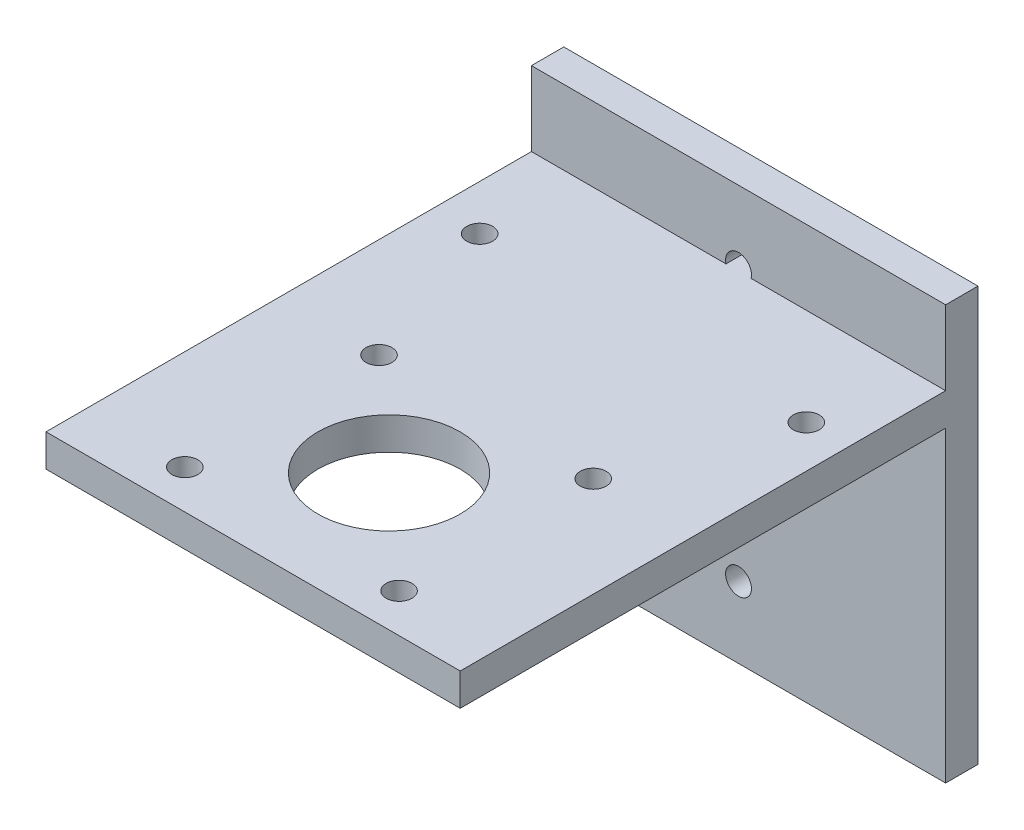
ISO-10303-21;
HEADER;
FILE_DESCRIPTION(('STEP AP214'),'2;1');
FILE_NAME('part.step','',(''),(''),'','','');
FILE_SCHEMA(('AUTOMOTIVE_DESIGN { 1 0 10303 214 1 1 1 1 }'));
ENDSEC;
DATA;
#1=APPLICATION_CONTEXT('core data for automotive mechanical design processes');
#2=APPLICATION_PROTOCOL_DEFINITION('international standard','automotive_design',2000,#1);
#3=PRODUCT_CONTEXT('',#1,'mechanical');
#4=PRODUCT('Part','Part','',(#3));
#5=PRODUCT_RELATED_PRODUCT_CATEGORY('part','',(#4));
#6=PRODUCT_DEFINITION_FORMATION('','',#4);
#7=PRODUCT_DEFINITION_CONTEXT('part definition',#1,'design');
#8=PRODUCT_DEFINITION('design','',#6,#7);
#9=PRODUCT_DEFINITION_SHAPE('','',#8);
#10=(LENGTH_UNIT() NAMED_UNIT(*) SI_UNIT(.MILLI.,.METRE.));
#11=(NAMED_UNIT(*) PLANE_ANGLE_UNIT() SI_UNIT($,.RADIAN.));
#12=(NAMED_UNIT(*) SI_UNIT($,.STERADIAN.) SOLID_ANGLE_UNIT());
#13=UNCERTAINTY_MEASURE_WITH_UNIT(LENGTH_MEASURE(1.E-05),#10,'distance_accuracy_value','');
#14=(GEOMETRIC_REPRESENTATION_CONTEXT(3) GLOBAL_UNCERTAINTY_ASSIGNED_CONTEXT((#13)) GLOBAL_UNIT_ASSIGNED_CONTEXT((#10,
#11,#12)) REPRESENTATION_CONTEXT('',''));
#15=CARTESIAN_POINT('',(0.,0.,0.));
#16=DIRECTION('',(0.,0.,1.));
#17=DIRECTION('',(1.,0.,0.));
#18=AXIS2_PLACEMENT_3D('',#15,#16,#17);
#19=CARTESIAN_POINT('',(0.,47.5,80.));
#20=DIRECTION('',(0.,1.,0.));
#21=DIRECTION('',(0.,0.,1.));
#22=AXIS2_PLACEMENT_3D('',#19,#20,#21);
#23=PLANE('',#22);
#24=CARTESIAN_POINT('',(7.00364438503408,47.5,20.));
#25=DIRECTION('',(0.,1.,0.));
#26=DIRECTION('',(0.,0.,1.));
#27=AXIS2_PLACEMENT_3D('',#24,#25,#26);
#28=CIRCLE('',#27,2.);
#29=CARTESIAN_POINT('',(7.00364438503408,47.5,22.));
#30=VERTEX_POINT('',#29);
#31=EDGE_CURVE('E229',#30,#30,#28,.F.);
#32=ORIENTED_EDGE('',*,*,#31,.F.);
#33=EDGE_LOOP('',(#32));
#34=FACE_BOUND('',#33,.T.);
#35=CARTESIAN_POINT('',(15.45,47.5,44.));
#36=DIRECTION('',(0.,1.,0.));
#37=DIRECTION('',(0.,0.,1.));
#38=AXIS2_PLACEMENT_3D('',#35,#36,#37);
#39=CIRCLE('',#38,2.);
#40=CARTESIAN_POINT('',(15.45,47.5,46.));
#41=VERTEX_POINT('',#40);
#42=EDGE_CURVE('E222',#41,#41,#39,.F.);
#43=ORIENTED_EDGE('',*,*,#42,.F.);
#44=EDGE_LOOP('',(#43));
#45=FACE_BOUND('',#44,.T.);
#46=CARTESIAN_POINT('',(15.45,47.5,74.));
#47=DIRECTION('',(0.,1.,0.));
#48=DIRECTION('',(0.,0.,1.));
#49=AXIS2_PLACEMENT_3D('',#46,#47,#48);
#50=CIRCLE('',#49,2.);
#51=CARTESIAN_POINT('',(15.45,47.5,76.));
#52=VERTEX_POINT('',#51);
#53=EDGE_CURVE('E214',#52,#52,#50,.F.);
#54=ORIENTED_EDGE('',*,*,#53,.F.);
#55=EDGE_LOOP('',(#54));
#56=FACE_BOUND('',#55,.T.);
#57=DIRECTION('',(0.,0.,-1.));
#58=VECTOR('',#57,1.);
#59=CARTESIAN_POINT('',(0.,47.5,80.));
#60=LINE('',#59,#58);
#61=CARTESIAN_POINT('',(0.,47.5,80.));
#62=VERTEX_POINT('',#61);
#63=CARTESIAN_POINT('',(0.,47.5,5.));
#64=VERTEX_POINT('',#63);
#65=EDGE_CURVE('E126',#62,#64,#60,.T.);
#66=ORIENTED_EDGE('',*,*,#65,.T.);
#67=DIRECTION('',(1.,0.,0.));
#68=VECTOR('',#67,1.);
#69=CARTESIAN_POINT('',(0.,47.5,5.));
#70=LINE('',#69,#68);
#71=CARTESIAN_POINT('',(64.,47.5,5.));
#72=VERTEX_POINT('',#71);
#73=EDGE_CURVE('E151',#64,#72,#70,.T.);
#74=ORIENTED_EDGE('',*,*,#73,.T.);
#75=DIRECTION('',(0.,0.,-1.));
#76=VECTOR('',#75,1.);
#77=CARTESIAN_POINT('',(64.,47.5,80.));
#78=LINE('',#77,#76);
#79=CARTESIAN_POINT('',(64.,47.5,80.));
#80=VERTEX_POINT('',#79);
#81=EDGE_CURVE('E128',#80,#72,#78,.T.);
#82=ORIENTED_EDGE('',*,*,#81,.F.);
#83=DIRECTION('',(1.,0.,0.));
#84=VECTOR('',#83,1.);
#85=CARTESIAN_POINT('',(0.,47.5,80.));
#86=LINE('',#85,#84);
#87=EDGE_CURVE('E122',#62,#80,#86,.T.);
#88=ORIENTED_EDGE('',*,*,#87,.F.);
#89=EDGE_LOOP('',(#66,#74,#82,#88));
#90=FACE_BOUND('',#89,.T.);
#91=CARTESIAN_POINT('',(32.,47.5,59.));
#92=DIRECTION('',(0.,1.,0.));
#93=DIRECTION('',(0.,0.,1.));
#94=AXIS2_PLACEMENT_3D('',#91,#92,#93);
#95=CIRCLE('',#94,11.);
#96=CARTESIAN_POINT('',(32.,47.5,70.));
#97=VERTEX_POINT('',#96);
#98=EDGE_CURVE('E213',#97,#97,#95,.F.);
#99=ORIENTED_EDGE('',*,*,#98,.F.);
#100=EDGE_LOOP('',(#99));
#101=FACE_BOUND('',#100,.T.);
#102=CARTESIAN_POINT('',(48.55,47.5,74.));
#103=DIRECTION('',(0.,1.,0.));
#104=DIRECTION('',(0.,0.,1.));
#105=AXIS2_PLACEMENT_3D('',#102,#103,#104);
#106=CIRCLE('',#105,2.);
#107=CARTESIAN_POINT('',(48.55,47.5,76.));
#108=VERTEX_POINT('',#107);
#109=EDGE_CURVE('E218',#108,#108,#106,.F.);
#110=ORIENTED_EDGE('',*,*,#109,.F.);
#111=EDGE_LOOP('',(#110));
#112=FACE_BOUND('',#111,.T.);
#113=CARTESIAN_POINT('',(48.55,47.5,44.));
#114=DIRECTION('',(0.,1.,0.));
#115=DIRECTION('',(0.,0.,1.));
#116=AXIS2_PLACEMENT_3D('',#113,#114,#115);
#117=CIRCLE('',#116,2.);
#118=CARTESIAN_POINT('',(48.55,47.5,46.));
#119=VERTEX_POINT('',#118);
#120=EDGE_CURVE('E226',#119,#119,#117,.F.);
#121=ORIENTED_EDGE('',*,*,#120,.F.);
#122=EDGE_LOOP('',(#121));
#123=FACE_BOUND('',#122,.T.);
#124=CARTESIAN_POINT('',(57.4657707438855,47.5,20.));
#125=DIRECTION('',(0.,1.,0.));
#126=DIRECTION('',(0.,0.,1.));
#127=AXIS2_PLACEMENT_3D('',#124,#125,#126);
#128=CIRCLE('',#127,2.);
#129=CARTESIAN_POINT('',(57.4657707438855,47.5,22.));
#130=VERTEX_POINT('',#129);
#131=EDGE_CURVE('E232',#130,#130,#128,.F.);
#132=ORIENTED_EDGE('',*,*,#131,.F.);
#133=EDGE_LOOP('',(#132));
#134=FACE_BOUND('',#133,.T.);
#135=ADVANCED_FACE('F33',(#34,#45,#56,#90,#101,#112,#123,#134),#23,.F.);
#136=CARTESIAN_POINT('',(0.,52.5,80.));
#137=DIRECTION('',(0.,-1.,0.));
#138=DIRECTION('',(0.,0.,-1.));
#139=AXIS2_PLACEMENT_3D('',#136,#137,#138);
#140=PLANE('',#139);
#141=CARTESIAN_POINT('',(7.00364438503408,52.5,20.));
#142=DIRECTION('',(0.,-1.,0.));
#143=DIRECTION('',(0.,0.,-1.));
#144=AXIS2_PLACEMENT_3D('',#141,#142,#143);
#145=CIRCLE('',#144,2.);
#146=CARTESIAN_POINT('',(7.00364438503408,52.5,18.));
#147=VERTEX_POINT('',#146);
#148=EDGE_CURVE('E230',#147,#147,#145,.F.);
#149=ORIENTED_EDGE('',*,*,#148,.F.);
#150=EDGE_LOOP('',(#149));
#151=FACE_BOUND('',#150,.T.);
#152=CARTESIAN_POINT('',(15.45,52.5,44.));
#153=DIRECTION('',(0.,-1.,0.));
#154=DIRECTION('',(0.,0.,-1.));
#155=AXIS2_PLACEMENT_3D('',#152,#153,#154);
#156=CIRCLE('',#155,2.);
#157=CARTESIAN_POINT('',(15.45,52.5,42.));
#158=VERTEX_POINT('',#157);
#159=EDGE_CURVE('E223',#158,#158,#156,.F.);
#160=ORIENTED_EDGE('',*,*,#159,.F.);
#161=EDGE_LOOP('',(#160));
#162=FACE_BOUND('',#161,.T.);
#163=CARTESIAN_POINT('',(15.45,52.5,74.));
#164=DIRECTION('',(0.,-1.,0.));
#165=DIRECTION('',(0.,0.,-1.));
#166=AXIS2_PLACEMENT_3D('',#163,#164,#165);
#167=CIRCLE('',#166,2.);
#168=CARTESIAN_POINT('',(15.45,52.5,72.));
#169=VERTEX_POINT('',#168);
#170=EDGE_CURVE('E215',#169,#169,#167,.F.);
#171=ORIENTED_EDGE('',*,*,#170,.F.);
#172=EDGE_LOOP('',(#171));
#173=FACE_BOUND('',#172,.T.);
#174=DIRECTION('',(0.,0.,-1.));
#175=VECTOR('',#174,1.);
#176=CARTESIAN_POINT('',(30.0635083268963,52.5,5.));
#177=LINE('',#176,#175);
#178=CARTESIAN_POINT('',(30.0635083268963,52.5,5.));
#179=VERTEX_POINT('',#178);
#180=CARTESIAN_POINT('',(30.0635083268963,52.5,0.));
#181=VERTEX_POINT('',#180);
#182=EDGE_CURVE('E11',#179,#181,#177,.T.);
#183=ORIENTED_EDGE('',*,*,#182,.F.);
#184=DIRECTION('',(-1.,0.,0.));
#185=VECTOR('',#184,1.);
#186=CARTESIAN_POINT('',(0.,52.5,5.));
#187=LINE('',#186,#185);
#188=CARTESIAN_POINT('',(0.,52.5,5.));
#189=VERTEX_POINT('',#188);
#190=EDGE_CURVE('E145',#179,#189,#187,.T.);
#191=ORIENTED_EDGE('',*,*,#190,.T.);
#192=DIRECTION('',(0.,0.,-1.));
#193=VECTOR('',#192,1.);
#194=CARTESIAN_POINT('',(0.,52.5,80.));
#195=LINE('',#194,#193);
#196=CARTESIAN_POINT('',(0.,52.5,80.));
#197=VERTEX_POINT('',#196);
#198=EDGE_CURVE('E255',#197,#189,#195,.T.);
#199=ORIENTED_EDGE('',*,*,#198,.F.);
#200=DIRECTION('',(-1.,0.,0.));
#201=VECTOR('',#200,1.);
#202=CARTESIAN_POINT('',(0.,52.5,80.));
#203=LINE('',#202,#201);
#204=CARTESIAN_POINT('',(64.,52.5,80.));
#205=VERTEX_POINT('',#204);
#206=EDGE_CURVE('E137',#205,#197,#203,.T.);
#207=ORIENTED_EDGE('',*,*,#206,.F.);
#208=DIRECTION('',(0.,0.,-1.));
#209=VECTOR('',#208,1.);
#210=CARTESIAN_POINT('',(64.,52.5,80.));
#211=LINE('',#210,#209);
#212=CARTESIAN_POINT('',(64.,52.5,5.));
#213=VERTEX_POINT('',#212);
#214=EDGE_CURVE('E147',#205,#213,#211,.T.);
#215=ORIENTED_EDGE('',*,*,#214,.T.);
#216=CARTESIAN_POINT('',(33.9364916731037,52.5,5.));
#217=VERTEX_POINT('',#216);
#218=EDGE_CURVE('E143',#213,#217,#187,.T.);
#219=ORIENTED_EDGE('',*,*,#218,.T.);
#220=DIRECTION('',(0.,0.,-1.));
#221=VECTOR('',#220,1.);
#222=CARTESIAN_POINT('',(33.9364916731037,52.5,5.));
#223=LINE('',#222,#221);
#224=CARTESIAN_POINT('',(33.9364916731037,52.5,0.));
#225=VERTEX_POINT('',#224);
#226=EDGE_CURVE('E42',#225,#217,#223,.F.);
#227=ORIENTED_EDGE('',*,*,#226,.F.);
#228=DIRECTION('',(-1.,0.,0.));
#229=VECTOR('',#228,1.);
#230=CARTESIAN_POINT('',(0.,52.5,0.));
#231=LINE('',#230,#229);
#232=EDGE_CURVE('E49',#225,#181,#231,.T.);
#233=ORIENTED_EDGE('',*,*,#232,.T.);
#234=EDGE_LOOP('',(#183,#191,#199,#207,#215,#219,#227,#233));
#235=FACE_BOUND('',#234,.T.);
#236=CARTESIAN_POINT('',(32.,52.5,59.));
#237=DIRECTION('',(0.,-1.,0.));
#238=DIRECTION('',(0.,0.,-1.));
#239=AXIS2_PLACEMENT_3D('',#236,#237,#238);
#240=CIRCLE('',#239,11.);
#241=CARTESIAN_POINT('',(32.,52.5,48.));
#242=VERTEX_POINT('',#241);
#243=EDGE_CURVE('E210',#242,#242,#240,.F.);
#244=ORIENTED_EDGE('',*,*,#243,.F.);
#245=EDGE_LOOP('',(#244));
#246=FACE_BOUND('',#245,.T.);
#247=CARTESIAN_POINT('',(48.55,52.5,74.));
#248=DIRECTION('',(0.,-1.,0.));
#249=DIRECTION('',(0.,0.,-1.));
#250=AXIS2_PLACEMENT_3D('',#247,#248,#249);
#251=CIRCLE('',#250,2.);
#252=CARTESIAN_POINT('',(48.55,52.5,72.));
#253=VERTEX_POINT('',#252);
#254=EDGE_CURVE('E219',#253,#253,#251,.F.);
#255=ORIENTED_EDGE('',*,*,#254,.F.);
#256=EDGE_LOOP('',(#255));
#257=FACE_BOUND('',#256,.T.);
#258=CARTESIAN_POINT('',(48.55,52.5,44.));
#259=DIRECTION('',(0.,-1.,0.));
#260=DIRECTION('',(0.,0.,-1.));
#261=AXIS2_PLACEMENT_3D('',#258,#259,#260);
#262=CIRCLE('',#261,2.);
#263=CARTESIAN_POINT('',(48.55,52.5,42.));
#264=VERTEX_POINT('',#263);
#265=EDGE_CURVE('E227',#264,#264,#262,.F.);
#266=ORIENTED_EDGE('',*,*,#265,.F.);
#267=EDGE_LOOP('',(#266));
#268=FACE_BOUND('',#267,.T.);
#269=CARTESIAN_POINT('',(57.4657707438855,52.5,20.));
#270=DIRECTION('',(0.,-1.,0.));
#271=DIRECTION('',(0.,0.,-1.));
#272=AXIS2_PLACEMENT_3D('',#269,#270,#271);
#273=CIRCLE('',#272,2.);
#274=CARTESIAN_POINT('',(57.4657707438855,52.5,18.));
#275=VERTEX_POINT('',#274);
#276=EDGE_CURVE('E37',#275,#275,#273,.F.);
#277=ORIENTED_EDGE('',*,*,#276,.F.);
#278=EDGE_LOOP('',(#277));
#279=FACE_BOUND('',#278,.T.);
#280=ADVANCED_FACE('F260',(#151,#162,#173,#235,#246,#257,#268,#279),#140,.F.);
#281=CARTESIAN_POINT('',(0.,0.,5.));
#282=DIRECTION('',(0.,0.,-1.));
#283=DIRECTION('',(-1.,0.,0.));
#284=AXIS2_PLACEMENT_3D('',#281,#282,#283);
#285=PLANE('',#284);
#286=CARTESIAN_POINT('',(32.,11.,5.));
#287=DIRECTION('',(0.,0.,1.));
#288=DIRECTION('',(1.,0.,0.));
#289=AXIS2_PLACEMENT_3D('',#286,#287,#288);
#290=CIRCLE('',#289,2.);
#291=CARTESIAN_POINT('',(34.,11.,5.));
#292=VERTEX_POINT('',#291);
#293=EDGE_CURVE('E154',#292,#292,#290,.T.);
#294=ORIENTED_EDGE('',*,*,#293,.F.);
#295=EDGE_LOOP('',(#294));
#296=FACE_BOUND('',#295,.T.);
#297=CARTESIAN_POINT('',(32.,21.5,5.));
#298=DIRECTION('',(0.,0.,1.));
#299=DIRECTION('',(1.,0.,0.));
#300=AXIS2_PLACEMENT_3D('',#297,#298,#299);
#301=CIRCLE('',#300,2.);
#302=CARTESIAN_POINT('',(34.,21.5,5.));
#303=VERTEX_POINT('',#302);
#304=EDGE_CURVE('E165',#303,#303,#301,.T.);
#305=ORIENTED_EDGE('',*,*,#304,.F.);
#306=EDGE_LOOP('',(#305));
#307=FACE_BOUND('',#306,.T.);
#308=CARTESIAN_POINT('',(32.,42.5,5.));
#309=DIRECTION('',(0.,0.,1.));
#310=DIRECTION('',(1.,0.,0.));
#311=AXIS2_PLACEMENT_3D('',#308,#309,#310);
#312=CIRCLE('',#311,2.);
#313=CARTESIAN_POINT('',(34.,42.5,5.));
#314=VERTEX_POINT('',#313);
#315=EDGE_CURVE('E177',#314,#314,#312,.T.);
#316=ORIENTED_EDGE('',*,*,#315,.F.);
#317=EDGE_LOOP('',(#316));
#318=FACE_BOUND('',#317,.T.);
#319=CARTESIAN_POINT('',(32.,32.,5.));
#320=DIRECTION('',(0.,0.,1.));
#321=DIRECTION('',(1.,0.,0.));
#322=AXIS2_PLACEMENT_3D('',#319,#320,#321);
#323=CIRCLE('',#322,2.);
#324=CARTESIAN_POINT('',(34.,32.,5.));
#325=VERTEX_POINT('',#324);
#326=EDGE_CURVE('E171',#325,#325,#323,.T.);
#327=ORIENTED_EDGE('',*,*,#326,.F.);
#328=EDGE_LOOP('',(#327));
#329=FACE_BOUND('',#328,.T.);
#330=ORIENTED_EDGE('',*,*,#73,.F.);
#331=DIRECTION('',(0.,-1.,0.));
#332=VECTOR('',#331,1.);
#333=CARTESIAN_POINT('',(0.,0.,5.));
#334=LINE('',#333,#332);
#335=CARTESIAN_POINT('',(0.,0.,5.));
#336=VERTEX_POINT('',#335);
#337=EDGE_CURVE('E87',#64,#336,#334,.T.);
#338=ORIENTED_EDGE('',*,*,#337,.T.);
#339=DIRECTION('',(1.,0.,0.));
#340=VECTOR('',#339,1.);
#341=CARTESIAN_POINT('',(0.,0.,5.));
#342=LINE('',#341,#340);
#343=CARTESIAN_POINT('',(64.,0.,5.));
#344=VERTEX_POINT('',#343);
#345=EDGE_CURVE('E185',#336,#344,#342,.T.);
#346=ORIENTED_EDGE('',*,*,#345,.T.);
#347=DIRECTION('',(0.,1.,0.));
#348=VECTOR('',#347,1.);
#349=CARTESIAN_POINT('',(64.,0.,5.));
#350=LINE('',#349,#348);
#351=EDGE_CURVE('E188',#344,#72,#350,.T.);
#352=ORIENTED_EDGE('',*,*,#351,.T.);
#353=EDGE_LOOP('',(#330,#338,#346,#352));
#354=FACE_BOUND('',#353,.T.);
#355=ADVANCED_FACE('F311',(#296,#307,#318,#329,#354),#285,.F.);
#356=ORIENTED_EDGE('',*,*,#218,.F.);
#357=CARTESIAN_POINT('',(64.,64.,5.));
#358=VERTEX_POINT('',#357);
#359=EDGE_CURVE('E187',#213,#358,#350,.T.);
#360=ORIENTED_EDGE('',*,*,#359,.T.);
#361=DIRECTION('',(-1.,0.,0.));
#362=VECTOR('',#361,1.);
#363=CARTESIAN_POINT('',(0.,64.,5.));
#364=LINE('',#363,#362);
#365=CARTESIAN_POINT('',(0.,64.,5.));
#366=VERTEX_POINT('',#365);
#367=EDGE_CURVE('E58',#358,#366,#364,.T.);
#368=ORIENTED_EDGE('',*,*,#367,.T.);
#369=EDGE_CURVE('E183',#366,#189,#334,.T.);
#370=ORIENTED_EDGE('',*,*,#369,.T.);
#371=ORIENTED_EDGE('',*,*,#190,.F.);
#372=CARTESIAN_POINT('',(32.,53.,5.));
#373=DIRECTION('',(0.,0.,1.));
#374=DIRECTION('',(1.,0.,0.));
#375=AXIS2_PLACEMENT_3D('',#372,#373,#374);
#376=CIRCLE('',#375,2.);
#377=EDGE_CURVE('E160',#217,#179,#376,.T.);
#378=ORIENTED_EDGE('',*,*,#377,.F.);
#379=EDGE_LOOP('',(#356,#360,#368,#370,#371,#378));
#380=FACE_BOUND('',#379,.T.);
#381=ADVANCED_FACE('F265',(#380),#285,.F.);
#382=CARTESIAN_POINT('',(32.,53.,5.));
#383=DIRECTION('',(0.,0.,-1.));
#384=DIRECTION('',(-1.,0.,0.));
#385=AXIS2_PLACEMENT_3D('',#382,#383,#384);
#386=CYLINDRICAL_SURFACE('',#385,2.);
#387=ORIENTED_EDGE('',*,*,#377,.T.);
#388=ORIENTED_EDGE('',*,*,#182,.T.);
#389=CARTESIAN_POINT('',(32.,53.,0.));
#390=DIRECTION('',(0.,0.,1.));
#391=DIRECTION('',(1.,0.,0.));
#392=AXIS2_PLACEMENT_3D('',#389,#390,#391);
#393=CIRCLE('',#392,2.);
#394=EDGE_CURVE('E157',#225,#181,#393,.T.);
#395=ORIENTED_EDGE('',*,*,#394,.F.);
#396=ORIENTED_EDGE('',*,*,#226,.T.);
#397=EDGE_LOOP('',(#387,#388,#395,#396));
#398=FACE_BOUND('',#397,.T.);
#399=ADVANCED_FACE('F274',(#398),#386,.F.);
#400=CARTESIAN_POINT('',(0.,0.,0.));
#401=DIRECTION('',(0.,0.,-1.));
#402=DIRECTION('',(-1.,0.,0.));
#403=AXIS2_PLACEMENT_3D('',#400,#401,#402);
#404=PLANE('',#403);
#405=ORIENTED_EDGE('',*,*,#232,.F.);
#406=ORIENTED_EDGE('',*,*,#394,.T.);
#407=EDGE_LOOP('',(#405,#406));
#408=FACE_BOUND('',#407,.T.);
#409=DIRECTION('',(-1.,0.,0.));
#410=VECTOR('',#409,1.);
#411=CARTESIAN_POINT('',(0.,64.,0.));
#412=LINE('',#411,#410);
#413=CARTESIAN_POINT('',(64.,64.,0.));
#414=VERTEX_POINT('',#413);
#415=CARTESIAN_POINT('',(0.,64.,0.));
#416=VERTEX_POINT('',#415);
#417=EDGE_CURVE('E79',#414,#416,#412,.T.);
#418=ORIENTED_EDGE('',*,*,#417,.F.);
#419=DIRECTION('',(0.,1.,0.));
#420=VECTOR('',#419,1.);
#421=CARTESIAN_POINT('',(64.,0.,0.));
#422=LINE('',#421,#420);
#423=CARTESIAN_POINT('',(64.,0.,0.));
#424=VERTEX_POINT('',#423);
#425=EDGE_CURVE('E196',#424,#414,#422,.T.);
#426=ORIENTED_EDGE('',*,*,#425,.F.);
#427=DIRECTION('',(1.,0.,0.));
#428=VECTOR('',#427,1.);
#429=CARTESIAN_POINT('',(0.,0.,0.));
#430=LINE('',#429,#428);
#431=CARTESIAN_POINT('',(0.,0.,0.));
#432=VERTEX_POINT('',#431);
#433=EDGE_CURVE('E194',#432,#424,#430,.T.);
#434=ORIENTED_EDGE('',*,*,#433,.F.);
#435=DIRECTION('',(0.,-1.,0.));
#436=VECTOR('',#435,1.);
#437=CARTESIAN_POINT('',(0.,0.,0.));
#438=LINE('',#437,#436);
#439=EDGE_CURVE('E180',#416,#432,#438,.T.);
#440=ORIENTED_EDGE('',*,*,#439,.F.);
#441=EDGE_LOOP('',(#418,#426,#434,#440));
#442=FACE_BOUND('',#441,.T.);
#443=CARTESIAN_POINT('',(32.,11.,0.));
#444=DIRECTION('',(0.,0.,1.));
#445=DIRECTION('',(1.,0.,0.));
#446=AXIS2_PLACEMENT_3D('',#443,#444,#445);
#447=CIRCLE('',#446,2.);
#448=CARTESIAN_POINT('',(34.,11.,0.));
#449=VERTEX_POINT('',#448);
#450=EDGE_CURVE('E153',#449,#449,#447,.T.);
#451=ORIENTED_EDGE('',*,*,#450,.T.);
#452=EDGE_LOOP('',(#451));
#453=FACE_BOUND('',#452,.T.);
#454=CARTESIAN_POINT('',(32.,21.5,0.));
#455=DIRECTION('',(0.,0.,1.));
#456=DIRECTION('',(1.,0.,0.));
#457=AXIS2_PLACEMENT_3D('',#454,#455,#456);
#458=CIRCLE('',#457,2.);
#459=CARTESIAN_POINT('',(34.,21.5,0.));
#460=VERTEX_POINT('',#459);
#461=EDGE_CURVE('E163',#460,#460,#458,.T.);
#462=ORIENTED_EDGE('',*,*,#461,.T.);
#463=EDGE_LOOP('',(#462));
#464=FACE_BOUND('',#463,.T.);
#465=CARTESIAN_POINT('',(32.,42.5,0.));
#466=DIRECTION('',(0.,0.,1.));
#467=DIRECTION('',(1.,0.,0.));
#468=AXIS2_PLACEMENT_3D('',#465,#466,#467);
#469=CIRCLE('',#468,2.);
#470=CARTESIAN_POINT('',(34.,42.5,0.));
#471=VERTEX_POINT('',#470);
#472=EDGE_CURVE('E174',#471,#471,#469,.T.);
#473=ORIENTED_EDGE('',*,*,#472,.T.);
#474=EDGE_LOOP('',(#473));
#475=FACE_BOUND('',#474,.T.);
#476=CARTESIAN_POINT('',(32.,32.,0.));
#477=DIRECTION('',(0.,0.,1.));
#478=DIRECTION('',(1.,0.,0.));
#479=AXIS2_PLACEMENT_3D('',#476,#477,#478);
#480=CIRCLE('',#479,2.);
#481=CARTESIAN_POINT('',(34.,32.,0.));
#482=VERTEX_POINT('',#481);
#483=EDGE_CURVE('E168',#482,#482,#480,.T.);
#484=ORIENTED_EDGE('',*,*,#483,.T.);
#485=EDGE_LOOP('',(#484));
#486=FACE_BOUND('',#485,.T.);
#487=ADVANCED_FACE('F276',(#408,#442,#453,#464,#475,#486),#404,.T.);
#488=CARTESIAN_POINT('',(0.,0.,5.));
#489=DIRECTION('',(1.,0.,0.));
#490=DIRECTION('',(0.,1.,0.));
#491=AXIS2_PLACEMENT_3D('',#488,#489,#490);
#492=PLANE('',#491);
#493=ORIENTED_EDGE('',*,*,#439,.T.);
#494=DIRECTION('',(0.,0.,-1.));
#495=VECTOR('',#494,1.);
#496=CARTESIAN_POINT('',(0.,0.,5.));
#497=LINE('',#496,#495);
#498=EDGE_CURVE('E205',#336,#432,#497,.T.);
#499=ORIENTED_EDGE('',*,*,#498,.F.);
#500=ORIENTED_EDGE('',*,*,#337,.F.);
#501=ORIENTED_EDGE('',*,*,#65,.F.);
#502=DIRECTION('',(0.,-1.,0.));
#503=VECTOR('',#502,1.);
#504=CARTESIAN_POINT('',(0.,52.5,80.));
#505=LINE('',#504,#503);
#506=EDGE_CURVE('E132',#197,#62,#505,.T.);
#507=ORIENTED_EDGE('',*,*,#506,.F.);
#508=ORIENTED_EDGE('',*,*,#198,.T.);
#509=ORIENTED_EDGE('',*,*,#369,.F.);
#510=DIRECTION('',(0.,0.,-1.));
#511=VECTOR('',#510,1.);
#512=CARTESIAN_POINT('',(0.,64.,5.));
#513=LINE('',#512,#511);
#514=EDGE_CURVE('E192',#366,#416,#513,.T.);
#515=ORIENTED_EDGE('',*,*,#514,.T.);
#516=EDGE_LOOP('',(#493,#499,#500,#501,#507,#508,#509,#515));
#517=FACE_BOUND('',#516,.T.);
#518=ADVANCED_FACE('F35',(#517),#492,.F.);
#519=CARTESIAN_POINT('',(0.,0.,5.));
#520=DIRECTION('',(0.,1.,0.));
#521=DIRECTION('',(0.,0.,1.));
#522=AXIS2_PLACEMENT_3D('',#519,#520,#521);
#523=PLANE('',#522);
#524=ORIENTED_EDGE('',*,*,#433,.T.);
#525=DIRECTION('',(0.,0.,-1.));
#526=VECTOR('',#525,1.);
#527=CARTESIAN_POINT('',(64.,0.,5.));
#528=LINE('',#527,#526);
#529=EDGE_CURVE('E202',#344,#424,#528,.T.);
#530=ORIENTED_EDGE('',*,*,#529,.F.);
#531=ORIENTED_EDGE('',*,*,#345,.F.);
#532=ORIENTED_EDGE('',*,*,#498,.T.);
#533=EDGE_LOOP('',(#524,#530,#531,#532));
#534=FACE_BOUND('',#533,.T.);
#535=ADVANCED_FACE('F334',(#534),#523,.F.);
#536=CARTESIAN_POINT('',(64.,0.,5.));
#537=DIRECTION('',(-1.,0.,0.));
#538=DIRECTION('',(0.,-1.,0.));
#539=AXIS2_PLACEMENT_3D('',#536,#537,#538);
#540=PLANE('',#539);
#541=ORIENTED_EDGE('',*,*,#359,.F.);
#542=ORIENTED_EDGE('',*,*,#214,.F.);
#543=DIRECTION('',(0.,1.,0.));
#544=VECTOR('',#543,1.);
#545=CARTESIAN_POINT('',(64.,52.5,80.));
#546=LINE('',#545,#544);
#547=EDGE_CURVE('E131',#80,#205,#546,.T.);
#548=ORIENTED_EDGE('',*,*,#547,.F.);
#549=ORIENTED_EDGE('',*,*,#81,.T.);
#550=ORIENTED_EDGE('',*,*,#351,.F.);
#551=ORIENTED_EDGE('',*,*,#529,.T.);
#552=ORIENTED_EDGE('',*,*,#425,.T.);
#553=DIRECTION('',(0.,0.,-1.));
#554=VECTOR('',#553,1.);
#555=CARTESIAN_POINT('',(64.,64.,5.));
#556=LINE('',#555,#554);
#557=EDGE_CURVE('E200',#358,#414,#556,.T.);
#558=ORIENTED_EDGE('',*,*,#557,.F.);
#559=EDGE_LOOP('',(#541,#542,#548,#549,#550,#551,#552,#558));
#560=FACE_BOUND('',#559,.T.);
#561=ADVANCED_FACE('F268',(#560),#540,.F.);
#562=CARTESIAN_POINT('',(0.,64.,5.));
#563=DIRECTION('',(0.,-1.,0.));
#564=DIRECTION('',(0.,0.,-1.));
#565=AXIS2_PLACEMENT_3D('',#562,#563,#564);
#566=PLANE('',#565);
#567=ORIENTED_EDGE('',*,*,#417,.T.);
#568=ORIENTED_EDGE('',*,*,#514,.F.);
#569=ORIENTED_EDGE('',*,*,#367,.F.);
#570=ORIENTED_EDGE('',*,*,#557,.T.);
#571=EDGE_LOOP('',(#567,#568,#569,#570));
#572=FACE_BOUND('',#571,.T.);
#573=ADVANCED_FACE('F270',(#572),#566,.F.);
#574=CARTESIAN_POINT('',(32.,42.5,5.));
#575=DIRECTION('',(0.,0.,-1.));
#576=DIRECTION('',(-1.,0.,0.));
#577=AXIS2_PLACEMENT_3D('',#574,#575,#576);
#578=CYLINDRICAL_SURFACE('',#577,2.);
#579=ORIENTED_EDGE('',*,*,#315,.T.);
#580=EDGE_LOOP('',(#579));
#581=FACE_BOUND('',#580,.T.);
#582=ORIENTED_EDGE('',*,*,#472,.F.);
#583=EDGE_LOOP('',(#582));
#584=FACE_BOUND('',#583,.T.);
#585=ADVANCED_FACE('F292',(#581,#584),#578,.F.);
#586=CARTESIAN_POINT('',(32.,32.,5.));
#587=DIRECTION('',(0.,0.,-1.));
#588=DIRECTION('',(-1.,0.,0.));
#589=AXIS2_PLACEMENT_3D('',#586,#587,#588);
#590=CYLINDRICAL_SURFACE('',#589,2.);
#591=ORIENTED_EDGE('',*,*,#326,.T.);
#592=EDGE_LOOP('',(#591));
#593=FACE_BOUND('',#592,.T.);
#594=ORIENTED_EDGE('',*,*,#483,.F.);
#595=EDGE_LOOP('',(#594));
#596=FACE_BOUND('',#595,.T.);
#597=ADVANCED_FACE('F289',(#593,#596),#590,.F.);
#598=CARTESIAN_POINT('',(32.,21.5,5.));
#599=DIRECTION('',(0.,0.,-1.));
#600=DIRECTION('',(-1.,0.,0.));
#601=AXIS2_PLACEMENT_3D('',#598,#599,#600);
#602=CYLINDRICAL_SURFACE('',#601,2.);
#603=ORIENTED_EDGE('',*,*,#304,.T.);
#604=EDGE_LOOP('',(#603));
#605=FACE_BOUND('',#604,.T.);
#606=ORIENTED_EDGE('',*,*,#461,.F.);
#607=EDGE_LOOP('',(#606));
#608=FACE_BOUND('',#607,.T.);
#609=ADVANCED_FACE('F291',(#605,#608),#602,.F.);
#610=CARTESIAN_POINT('',(32.,11.,5.));
#611=DIRECTION('',(0.,0.,-1.));
#612=DIRECTION('',(-1.,0.,0.));
#613=AXIS2_PLACEMENT_3D('',#610,#611,#612);
#614=CYLINDRICAL_SURFACE('',#613,2.);
#615=ORIENTED_EDGE('',*,*,#293,.T.);
#616=EDGE_LOOP('',(#615));
#617=FACE_BOUND('',#616,.T.);
#618=ORIENTED_EDGE('',*,*,#450,.F.);
#619=EDGE_LOOP('',(#618));
#620=FACE_BOUND('',#619,.T.);
#621=ADVANCED_FACE('F299',(#617,#620),#614,.F.);
#622=CARTESIAN_POINT('',(0.,0.,80.));
#623=DIRECTION('',(0.,0.,1.));
#624=DIRECTION('',(1.,0.,0.));
#625=AXIS2_PLACEMENT_3D('',#622,#623,#624);
#626=PLANE('',#625);
#627=ORIENTED_EDGE('',*,*,#506,.T.);
#628=ORIENTED_EDGE('',*,*,#87,.T.);
#629=ORIENTED_EDGE('',*,*,#547,.T.);
#630=ORIENTED_EDGE('',*,*,#206,.T.);
#631=EDGE_LOOP('',(#627,#628,#629,#630));
#632=FACE_BOUND('',#631,.T.);
#633=ADVANCED_FACE('F135',(#632),#626,.T.);
#634=CARTESIAN_POINT('',(32.,114.,59.));
#635=DIRECTION('',(0.,-1.,0.));
#636=DIRECTION('',(0.,0.,-1.));
#637=AXIS2_PLACEMENT_3D('',#634,#635,#636);
#638=CYLINDRICAL_SURFACE('',#637,11.);
#639=ORIENTED_EDGE('',*,*,#243,.T.);
#640=EDGE_LOOP('',(#639));
#641=FACE_BOUND('',#640,.T.);
#642=ORIENTED_EDGE('',*,*,#98,.T.);
#643=EDGE_LOOP('',(#642));
#644=FACE_BOUND('',#643,.T.);
#645=ADVANCED_FACE('F418',(#641,#644),#638,.F.);
#646=CARTESIAN_POINT('',(15.45,114.,74.));
#647=DIRECTION('',(0.,-1.,0.));
#648=DIRECTION('',(0.,0.,-1.));
#649=AXIS2_PLACEMENT_3D('',#646,#647,#648);
#650=CYLINDRICAL_SURFACE('',#649,2.);
#651=ORIENTED_EDGE('',*,*,#170,.T.);
#652=EDGE_LOOP('',(#651));
#653=FACE_BOUND('',#652,.T.);
#654=ORIENTED_EDGE('',*,*,#53,.T.);
#655=EDGE_LOOP('',(#654));
#656=FACE_BOUND('',#655,.T.);
#657=ADVANCED_FACE('F435',(#653,#656),#650,.F.);
#658=CARTESIAN_POINT('',(48.55,114.,74.));
#659=DIRECTION('',(0.,-1.,0.));
#660=DIRECTION('',(0.,0.,-1.));
#661=AXIS2_PLACEMENT_3D('',#658,#659,#660);
#662=CYLINDRICAL_SURFACE('',#661,2.);
#663=ORIENTED_EDGE('',*,*,#254,.T.);
#664=EDGE_LOOP('',(#663));
#665=FACE_BOUND('',#664,.T.);
#666=ORIENTED_EDGE('',*,*,#109,.T.);
#667=EDGE_LOOP('',(#666));
#668=FACE_BOUND('',#667,.T.);
#669=ADVANCED_FACE('F444',(#665,#668),#662,.F.);
#670=CARTESIAN_POINT('',(15.45,114.,44.));
#671=DIRECTION('',(0.,-1.,0.));
#672=DIRECTION('',(0.,0.,-1.));
#673=AXIS2_PLACEMENT_3D('',#670,#671,#672);
#674=CYLINDRICAL_SURFACE('',#673,2.);
#675=ORIENTED_EDGE('',*,*,#159,.T.);
#676=EDGE_LOOP('',(#675));
#677=FACE_BOUND('',#676,.T.);
#678=ORIENTED_EDGE('',*,*,#42,.T.);
#679=EDGE_LOOP('',(#678));
#680=FACE_BOUND('',#679,.T.);
#681=ADVANCED_FACE('F453',(#677,#680),#674,.F.);
#682=CARTESIAN_POINT('',(48.55,114.,44.));
#683=DIRECTION('',(0.,-1.,0.));
#684=DIRECTION('',(0.,0.,-1.));
#685=AXIS2_PLACEMENT_3D('',#682,#683,#684);
#686=CYLINDRICAL_SURFACE('',#685,2.);
#687=ORIENTED_EDGE('',*,*,#265,.T.);
#688=EDGE_LOOP('',(#687));
#689=FACE_BOUND('',#688,.T.);
#690=ORIENTED_EDGE('',*,*,#120,.T.);
#691=EDGE_LOOP('',(#690));
#692=FACE_BOUND('',#691,.T.);
#693=ADVANCED_FACE('F462',(#689,#692),#686,.F.);
#694=CARTESIAN_POINT('',(7.00364438503408,114.,20.));
#695=DIRECTION('',(0.,-1.,0.));
#696=DIRECTION('',(0.,0.,-1.));
#697=AXIS2_PLACEMENT_3D('',#694,#695,#696);
#698=CYLINDRICAL_SURFACE('',#697,2.);
#699=ORIENTED_EDGE('',*,*,#148,.T.);
#700=EDGE_LOOP('',(#699));
#701=FACE_BOUND('',#700,.T.);
#702=ORIENTED_EDGE('',*,*,#31,.T.);
#703=EDGE_LOOP('',(#702));
#704=FACE_BOUND('',#703,.T.);
#705=ADVANCED_FACE('F471',(#701,#704),#698,.F.);
#706=CARTESIAN_POINT('',(57.4657707438855,114.,20.));
#707=DIRECTION('',(0.,-1.,0.));
#708=DIRECTION('',(0.,0.,-1.));
#709=AXIS2_PLACEMENT_3D('',#706,#707,#708);
#710=CYLINDRICAL_SURFACE('',#709,2.);
#711=ORIENTED_EDGE('',*,*,#276,.T.);
#712=EDGE_LOOP('',(#711));
#713=FACE_BOUND('',#712,.T.);
#714=ORIENTED_EDGE('',*,*,#131,.T.);
#715=EDGE_LOOP('',(#714));
#716=FACE_BOUND('',#715,.T.);
#717=ADVANCED_FACE('F480',(#713,#716),#710,.F.);
#718=CLOSED_SHELL('',(#135,#280,#355,#381,#399,#487,#518,#535,#561,#573,#585,#597,#609,#621,
#633,#645,#657,#669,#681,#693,#705,#717));
#719=MANIFOLD_SOLID_BREP('B2',#718);
#720=ADVANCED_BREP_SHAPE_REPRESENTATION('',(#18,#719),#14);
#721=SHAPE_DEFINITION_REPRESENTATION(#9,#720);
ENDSEC;
END-ISO-10303-21;
